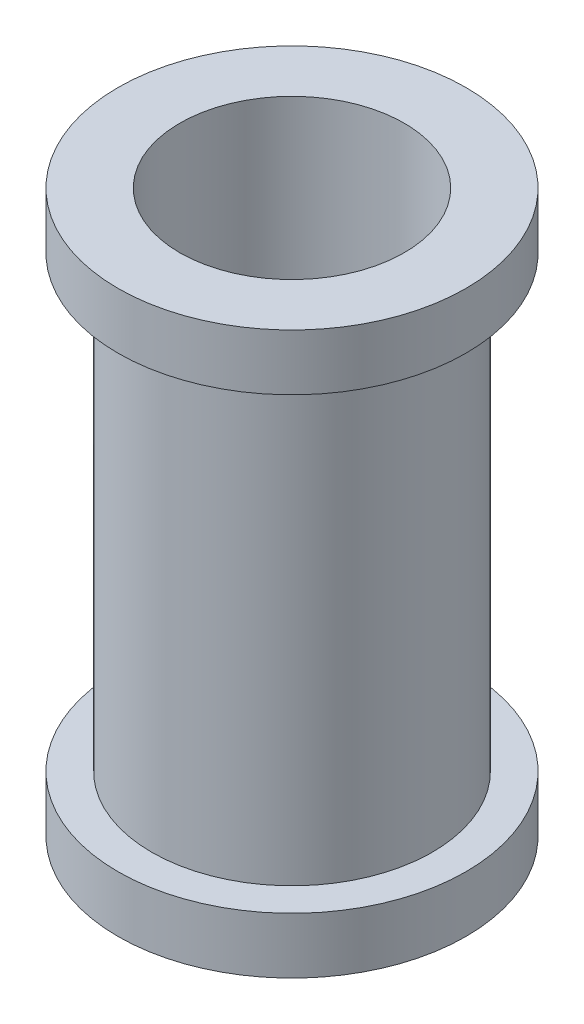
ISO-10303-21;
HEADER;
FILE_DESCRIPTION(('STEP AP214'),'2;1');
FILE_NAME('part.step','',(''),(''),'','','');
FILE_SCHEMA(('AUTOMOTIVE_DESIGN { 1 0 10303 214 1 1 1 1 }'));
ENDSEC;
DATA;
#1=APPLICATION_CONTEXT('core data for automotive mechanical design processes');
#2=APPLICATION_PROTOCOL_DEFINITION('international standard','automotive_design',2000,#1);
#3=PRODUCT_CONTEXT('',#1,'mechanical');
#4=PRODUCT('Part','Part','',(#3));
#5=PRODUCT_RELATED_PRODUCT_CATEGORY('part','',(#4));
#6=PRODUCT_DEFINITION_FORMATION('','',#4);
#7=PRODUCT_DEFINITION_CONTEXT('part definition',#1,'design');
#8=PRODUCT_DEFINITION('design','',#6,#7);
#9=PRODUCT_DEFINITION_SHAPE('','',#8);
#10=(LENGTH_UNIT() NAMED_UNIT(*) SI_UNIT(.MILLI.,.METRE.));
#11=(NAMED_UNIT(*) PLANE_ANGLE_UNIT() SI_UNIT($,.RADIAN.));
#12=(NAMED_UNIT(*) SI_UNIT($,.STERADIAN.) SOLID_ANGLE_UNIT());
#13=UNCERTAINTY_MEASURE_WITH_UNIT(LENGTH_MEASURE(1.E-05),#10,'distance_accuracy_value','');
#14=(GEOMETRIC_REPRESENTATION_CONTEXT(3) GLOBAL_UNCERTAINTY_ASSIGNED_CONTEXT((#13)) GLOBAL_UNIT_ASSIGNED_CONTEXT((#10,
#11,#12)) REPRESENTATION_CONTEXT('',''));
#15=CARTESIAN_POINT('',(0.,0.,0.));
#16=DIRECTION('',(0.,0.,1.));
#17=DIRECTION('',(1.,0.,0.));
#18=AXIS2_PLACEMENT_3D('',#15,#16,#17);
#19=CARTESIAN_POINT('',(0.,0.5,0.));
#20=DIRECTION('',(0.,-1.,0.));
#21=DIRECTION('',(0.,0.,-1.));
#22=AXIS2_PLACEMENT_3D('',#19,#20,#21);
#23=CYLINDRICAL_SURFACE('',#22,0.25);
#24=CARTESIAN_POINT('',(0.,0.1,0.));
#25=DIRECTION('',(0.,1.,0.));
#26=DIRECTION('',(0.,0.,1.));
#27=AXIS2_PLACEMENT_3D('',#24,#25,#26);
#28=CIRCLE('',#27,0.25);
#29=CARTESIAN_POINT('',(0.,0.1,0.25));
#30=VERTEX_POINT('',#29);
#31=EDGE_CURVE('E34',#30,#30,#28,.T.);
#32=ORIENTED_EDGE('',*,*,#31,.T.);
#33=EDGE_LOOP('',(#32));
#34=FACE_BOUND('',#33,.T.);
#35=CARTESIAN_POINT('',(0.,0.9,0.));
#36=DIRECTION('',(0.,1.,0.));
#37=DIRECTION('',(0.,0.,1.));
#38=AXIS2_PLACEMENT_3D('',#35,#36,#37);
#39=CIRCLE('',#38,0.25);
#40=CARTESIAN_POINT('',(0.,0.9,0.25));
#41=VERTEX_POINT('',#40);
#42=EDGE_CURVE('E49',#41,#41,#39,.T.);
#43=ORIENTED_EDGE('',*,*,#42,.F.);
#44=EDGE_LOOP('',(#43));
#45=FACE_BOUND('',#44,.T.);
#46=ADVANCED_FACE('F31',(#34,#45),#23,.T.);
#47=CARTESIAN_POINT('',(0.,0.,0.));
#48=DIRECTION('',(0.,1.,0.));
#49=DIRECTION('',(0.,0.,1.));
#50=AXIS2_PLACEMENT_3D('',#47,#48,#49);
#51=PLANE('',#50);
#52=CARTESIAN_POINT('',(0.,0.,0.));
#53=DIRECTION('',(0.,1.,0.));
#54=DIRECTION('',(0.,0.,1.));
#55=AXIS2_PLACEMENT_3D('',#52,#53,#54);
#56=CIRCLE('',#55,0.2);
#57=CARTESIAN_POINT('',(0.,0.,0.2));
#58=VERTEX_POINT('',#57);
#59=EDGE_CURVE('E10',#58,#58,#56,.T.);
#60=ORIENTED_EDGE('',*,*,#59,.T.);
#61=EDGE_LOOP('',(#60));
#62=FACE_BOUND('',#61,.T.);
#63=CARTESIAN_POINT('',(0.,0.,0.));
#64=DIRECTION('',(0.,1.,0.));
#65=DIRECTION('',(0.,0.,1.));
#66=AXIS2_PLACEMENT_3D('',#63,#64,#65);
#67=CIRCLE('',#66,0.31);
#68=CARTESIAN_POINT('',(0.,0.,0.31));
#69=VERTEX_POINT('',#68);
#70=EDGE_CURVE('E43',#69,#69,#67,.T.);
#71=ORIENTED_EDGE('',*,*,#70,.F.);
#72=EDGE_LOOP('',(#71));
#73=FACE_BOUND('',#72,.T.);
#74=ADVANCED_FACE('F74',(#62,#73),#51,.F.);
#75=CARTESIAN_POINT('',(0.,0.5,0.));
#76=DIRECTION('',(0.,-1.,0.));
#77=DIRECTION('',(0.,0.,-1.));
#78=AXIS2_PLACEMENT_3D('',#75,#76,#77);
#79=CYLINDRICAL_SURFACE('',#78,0.2);
#80=ORIENTED_EDGE('',*,*,#59,.F.);
#81=EDGE_LOOP('',(#80));
#82=FACE_BOUND('',#81,.T.);
#83=CARTESIAN_POINT('',(0.,1.,0.));
#84=DIRECTION('',(0.,1.,0.));
#85=DIRECTION('',(0.,0.,1.));
#86=AXIS2_PLACEMENT_3D('',#83,#84,#85);
#87=CIRCLE('',#86,0.2);
#88=CARTESIAN_POINT('',(0.,1.,0.2));
#89=VERTEX_POINT('',#88);
#90=EDGE_CURVE('E46',#89,#89,#87,.T.);
#91=ORIENTED_EDGE('',*,*,#90,.T.);
#92=EDGE_LOOP('',(#91));
#93=FACE_BOUND('',#92,.T.);
#94=ADVANCED_FACE('F79',(#82,#93),#79,.F.);
#95=CARTESIAN_POINT('',(0.,0.1,0.));
#96=DIRECTION('',(0.,-1.,0.));
#97=DIRECTION('',(0.,0.,-1.));
#98=AXIS2_PLACEMENT_3D('',#95,#96,#97);
#99=CYLINDRICAL_SURFACE('',#98,0.31);
#100=CARTESIAN_POINT('',(0.,0.1,0.));
#101=DIRECTION('',(0.,1.,0.));
#102=DIRECTION('',(0.,0.,1.));
#103=AXIS2_PLACEMENT_3D('',#100,#101,#102);
#104=CIRCLE('',#103,0.31);
#105=CARTESIAN_POINT('',(0.,0.1,0.31));
#106=VERTEX_POINT('',#105);
#107=EDGE_CURVE('E41',#106,#106,#104,.T.);
#108=ORIENTED_EDGE('',*,*,#107,.F.);
#109=EDGE_LOOP('',(#108));
#110=FACE_BOUND('',#109,.T.);
#111=ORIENTED_EDGE('',*,*,#70,.T.);
#112=EDGE_LOOP('',(#111));
#113=FACE_BOUND('',#112,.T.);
#114=ADVANCED_FACE('F87',(#110,#113),#99,.T.);
#115=CARTESIAN_POINT('',(0.,0.1,0.));
#116=DIRECTION('',(0.,1.,0.));
#117=DIRECTION('',(0.,0.,1.));
#118=AXIS2_PLACEMENT_3D('',#115,#116,#117);
#119=PLANE('',#118);
#120=ORIENTED_EDGE('',*,*,#31,.F.);
#121=EDGE_LOOP('',(#120));
#122=FACE_BOUND('',#121,.T.);
#123=ORIENTED_EDGE('',*,*,#107,.T.);
#124=EDGE_LOOP('',(#123));
#125=FACE_BOUND('',#124,.T.);
#126=ADVANCED_FACE('F84',(#122,#125),#119,.T.);
#127=CARTESIAN_POINT('',(0.,1.,0.));
#128=DIRECTION('',(0.,-1.,0.));
#129=DIRECTION('',(0.,0.,1.));
#130=AXIS2_PLACEMENT_3D('',#127,#128,#129);
#131=PLANE('',#130);
#132=ORIENTED_EDGE('',*,*,#90,.F.);
#133=EDGE_LOOP('',(#132));
#134=FACE_BOUND('',#133,.T.);
#135=CARTESIAN_POINT('',(0.,1.,0.));
#136=DIRECTION('',(0.,1.,0.));
#137=DIRECTION('',(0.,0.,1.));
#138=AXIS2_PLACEMENT_3D('',#135,#136,#137);
#139=CIRCLE('',#138,0.31);
#140=CARTESIAN_POINT('',(0.,1.,0.31));
#141=VERTEX_POINT('',#140);
#142=EDGE_CURVE('E55',#141,#141,#139,.T.);
#143=ORIENTED_EDGE('',*,*,#142,.T.);
#144=EDGE_LOOP('',(#143));
#145=FACE_BOUND('',#144,.T.);
#146=ADVANCED_FACE('F71',(#134,#145),#131,.F.);
#147=CARTESIAN_POINT('',(0.,0.9,0.));
#148=DIRECTION('',(0.,1.,0.));
#149=DIRECTION('',(0.,0.,-1.));
#150=AXIS2_PLACEMENT_3D('',#147,#148,#149);
#151=CYLINDRICAL_SURFACE('',#150,0.31);
#152=CARTESIAN_POINT('',(0.,0.9,0.));
#153=DIRECTION('',(0.,1.,0.));
#154=DIRECTION('',(0.,0.,1.));
#155=AXIS2_PLACEMENT_3D('',#152,#153,#154);
#156=CIRCLE('',#155,0.31);
#157=CARTESIAN_POINT('',(0.,0.9,0.31));
#158=VERTEX_POINT('',#157);
#159=EDGE_CURVE('E52',#158,#158,#156,.T.);
#160=ORIENTED_EDGE('',*,*,#159,.T.);
#161=EDGE_LOOP('',(#160));
#162=FACE_BOUND('',#161,.T.);
#163=ORIENTED_EDGE('',*,*,#142,.F.);
#164=EDGE_LOOP('',(#163));
#165=FACE_BOUND('',#164,.T.);
#166=ADVANCED_FACE('F61',(#162,#165),#151,.T.);
#167=CARTESIAN_POINT('',(0.,0.9,0.));
#168=DIRECTION('',(0.,-1.,0.));
#169=DIRECTION('',(0.,0.,1.));
#170=AXIS2_PLACEMENT_3D('',#167,#168,#169);
#171=PLANE('',#170);
#172=ORIENTED_EDGE('',*,*,#42,.T.);
#173=EDGE_LOOP('',(#172));
#174=FACE_BOUND('',#173,.T.);
#175=ORIENTED_EDGE('',*,*,#159,.F.);
#176=EDGE_LOOP('',(#175));
#177=FACE_BOUND('',#176,.T.);
#178=ADVANCED_FACE('F64',(#174,#177),#171,.T.);
#179=CLOSED_SHELL('',(#46,#74,#94,#114,#126,#146,#166,#178));
#180=MANIFOLD_SOLID_BREP('B2',#179);
#181=ADVANCED_BREP_SHAPE_REPRESENTATION('',(#18,#180),#14);
#182=SHAPE_DEFINITION_REPRESENTATION(#9,#181);
ENDSEC;
END-ISO-10303-21;
